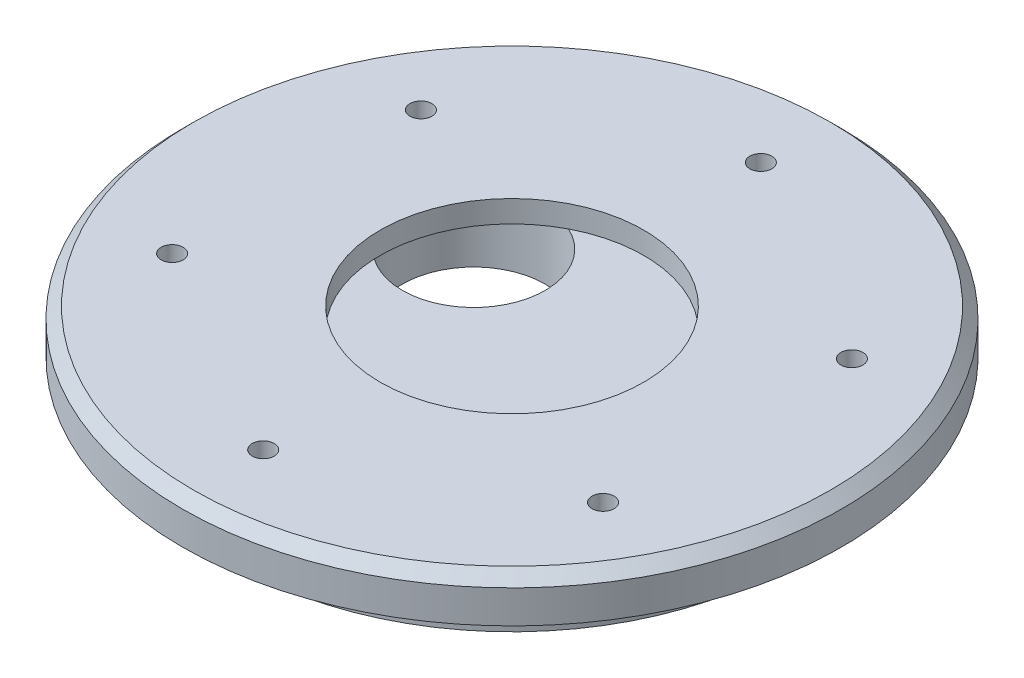
ISO-10303-21;
HEADER;
FILE_DESCRIPTION(('STEP AP214'),'2;1');
FILE_NAME('part.step','',(''),(''),'','','');
FILE_SCHEMA(('AUTOMOTIVE_DESIGN { 1 0 10303 214 1 1 1 1 }'));
ENDSEC;
DATA;
#1=APPLICATION_CONTEXT('core data for automotive mechanical design processes');
#2=APPLICATION_PROTOCOL_DEFINITION('international standard','automotive_design',2000,#1);
#3=PRODUCT_CONTEXT('',#1,'mechanical');
#4=PRODUCT('Part','Part','',(#3));
#5=PRODUCT_RELATED_PRODUCT_CATEGORY('part','',(#4));
#6=PRODUCT_DEFINITION_FORMATION('','',#4);
#7=PRODUCT_DEFINITION_CONTEXT('part definition',#1,'design');
#8=PRODUCT_DEFINITION('design','',#6,#7);
#9=PRODUCT_DEFINITION_SHAPE('','',#8);
#10=(LENGTH_UNIT() NAMED_UNIT(*) SI_UNIT(.MILLI.,.METRE.));
#11=(NAMED_UNIT(*) PLANE_ANGLE_UNIT() SI_UNIT($,.RADIAN.));
#12=(NAMED_UNIT(*) SI_UNIT($,.STERADIAN.) SOLID_ANGLE_UNIT());
#13=UNCERTAINTY_MEASURE_WITH_UNIT(LENGTH_MEASURE(1.E-05),#10,'distance_accuracy_value','');
#14=(GEOMETRIC_REPRESENTATION_CONTEXT(3) GLOBAL_UNCERTAINTY_ASSIGNED_CONTEXT((#13)) GLOBAL_UNIT_ASSIGNED_CONTEXT((#10,
#11,#12)) REPRESENTATION_CONTEXT('',''));
#15=CARTESIAN_POINT('',(0.,0.,0.));
#16=DIRECTION('',(0.,0.,1.));
#17=DIRECTION('',(1.,0.,0.));
#18=AXIS2_PLACEMENT_3D('',#15,#16,#17);
#19=CARTESIAN_POINT('',(0.,-4.,0.));
#20=DIRECTION('',(0.,1.,0.));
#21=DIRECTION('',(0.,0.,1.));
#22=AXIS2_PLACEMENT_3D('',#19,#20,#21);
#23=CYLINDRICAL_SURFACE('',#22,30.);
#24=CARTESIAN_POINT('',(0.,-0.999999999999994,0.));
#25=DIRECTION('',(0.,1.,0.));
#26=DIRECTION('',(0.,0.,1.));
#27=AXIS2_PLACEMENT_3D('',#24,#25,#26);
#28=CIRCLE('',#27,30.);
#29=CARTESIAN_POINT('',(0.,-0.999999999999994,30.));
#30=VERTEX_POINT('',#29);
#31=EDGE_CURVE('E11',#30,#30,#28,.F.);
#32=ORIENTED_EDGE('',*,*,#31,.T.);
#33=EDGE_LOOP('',(#32));
#34=FACE_BOUND('',#33,.T.);
#35=CARTESIAN_POINT('',(0.,-4.,0.));
#36=DIRECTION('',(0.,1.,0.));
#37=DIRECTION('',(0.,0.,1.));
#38=AXIS2_PLACEMENT_3D('',#35,#36,#37);
#39=CIRCLE('',#38,30.);
#40=CARTESIAN_POINT('',(0.,-4.,30.));
#41=VERTEX_POINT('',#40);
#42=EDGE_CURVE('E72',#41,#41,#39,.T.);
#43=ORIENTED_EDGE('',*,*,#42,.T.);
#44=EDGE_LOOP('',(#43));
#45=FACE_BOUND('',#44,.T.);
#46=ADVANCED_FACE('F33',(#34,#45),#23,.T.);
#47=CARTESIAN_POINT('',(0.,-4.,0.));
#48=DIRECTION('',(0.,1.,0.));
#49=DIRECTION('',(0.,0.,1.));
#50=AXIS2_PLACEMENT_3D('',#47,#48,#49);
#51=PLANE('',#50);
#52=CARTESIAN_POINT('',(0.,-4.,0.));
#53=DIRECTION('',(0.,1.,0.));
#54=DIRECTION('',(0.,0.,1.));
#55=AXIS2_PLACEMENT_3D('',#52,#53,#54);
#56=CIRCLE('',#55,25.);
#57=CARTESIAN_POINT('',(0.,-4.,25.));
#58=VERTEX_POINT('',#57);
#59=EDGE_CURVE('E83',#58,#58,#56,.F.);
#60=ORIENTED_EDGE('',*,*,#59,.F.);
#61=EDGE_LOOP('',(#60));
#62=FACE_BOUND('',#61,.T.);
#63=ORIENTED_EDGE('',*,*,#42,.F.);
#64=EDGE_LOOP('',(#63));
#65=FACE_BOUND('',#64,.T.);
#66=ADVANCED_FACE('F104',(#62,#65),#51,.F.);
#67=CARTESIAN_POINT('',(0.,0.,0.));
#68=DIRECTION('',(0.,1.,0.));
#69=DIRECTION('',(0.,0.,1.));
#70=AXIS2_PLACEMENT_3D('',#67,#68,#69);
#71=PLANE('',#70);
#72=CARTESIAN_POINT('',(19.6154753957174,0.,11.3250000000002));
#73=DIRECTION('',(0.,1.,0.));
#74=DIRECTION('',(0.,0.,1.));
#75=AXIS2_PLACEMENT_3D('',#72,#73,#74);
#76=CIRCLE('',#75,1.);
#77=CARTESIAN_POINT('',(19.6154753957174,0.,12.3250000000002));
#78=VERTEX_POINT('',#77);
#79=EDGE_CURVE('E251',#78,#78,#76,.T.);
#80=ORIENTED_EDGE('',*,*,#79,.F.);
#81=EDGE_LOOP('',(#80));
#82=FACE_BOUND('',#81,.T.);
#83=CARTESIAN_POINT('',(19.6154753957176,0.,-11.3249999999998));
#84=DIRECTION('',(0.,1.,0.));
#85=DIRECTION('',(0.,0.,1.));
#86=AXIS2_PLACEMENT_3D('',#83,#84,#85);
#87=CIRCLE('',#86,0.999999999999998);
#88=CARTESIAN_POINT('',(19.6154753957176,0.,-10.3249999999998));
#89=VERTEX_POINT('',#88);
#90=EDGE_CURVE('E255',#89,#89,#87,.T.);
#91=ORIENTED_EDGE('',*,*,#90,.F.);
#92=EDGE_LOOP('',(#91));
#93=FACE_BOUND('',#92,.T.);
#94=CARTESIAN_POINT('',(1.58164104649594E-13,0.,-22.65));
#95=DIRECTION('',(0.,1.,0.));
#96=DIRECTION('',(0.,0.,1.));
#97=AXIS2_PLACEMENT_3D('',#94,#95,#96);
#98=CIRCLE('',#97,1.);
#99=CARTESIAN_POINT('',(1.58164104649594E-13,0.,-21.65));
#100=VERTEX_POINT('',#99);
#101=EDGE_CURVE('E263',#100,#100,#98,.T.);
#102=ORIENTED_EDGE('',*,*,#101,.F.);
#103=EDGE_LOOP('',(#102));
#104=FACE_BOUND('',#103,.T.);
#105=CARTESIAN_POINT('',(-19.6154753957175,0.,-11.3250000000001));
#106=DIRECTION('',(0.,1.,0.));
#107=DIRECTION('',(0.,0.,1.));
#108=AXIS2_PLACEMENT_3D('',#105,#106,#107);
#109=CIRCLE('',#108,1.);
#110=CARTESIAN_POINT('',(-19.6154753957175,0.,-10.3250000000001));
#111=VERTEX_POINT('',#110);
#112=EDGE_CURVE('E269',#111,#111,#109,.T.);
#113=ORIENTED_EDGE('',*,*,#112,.F.);
#114=EDGE_LOOP('',(#113));
#115=FACE_BOUND('',#114,.T.);
#116=CARTESIAN_POINT('',(0.,0.,22.65));
#117=DIRECTION('',(0.,1.,0.));
#118=DIRECTION('',(0.,0.,1.));
#119=AXIS2_PLACEMENT_3D('',#116,#117,#118);
#120=CIRCLE('',#119,1.);
#121=CARTESIAN_POINT('',(0.,0.,23.65));
#122=VERTEX_POINT('',#121);
#123=EDGE_CURVE('E275',#122,#122,#120,.T.);
#124=ORIENTED_EDGE('',*,*,#123,.F.);
#125=EDGE_LOOP('',(#124));
#126=FACE_BOUND('',#125,.T.);
#127=CARTESIAN_POINT('',(-19.6154753957176,0.,11.325));
#128=DIRECTION('',(0.,1.,0.));
#129=DIRECTION('',(0.,0.,1.));
#130=AXIS2_PLACEMENT_3D('',#127,#128,#129);
#131=CIRCLE('',#130,1.);
#132=CARTESIAN_POINT('',(-19.6154753957176,0.,12.325));
#133=VERTEX_POINT('',#132);
#134=EDGE_CURVE('E79',#133,#133,#131,.T.);
#135=ORIENTED_EDGE('',*,*,#134,.F.);
#136=EDGE_LOOP('',(#135));
#137=FACE_BOUND('',#136,.T.);
#138=CARTESIAN_POINT('',(0.,0.,0.));
#139=DIRECTION('',(0.,1.,0.));
#140=DIRECTION('',(0.,0.,1.));
#141=AXIS2_PLACEMENT_3D('',#138,#139,#140);
#142=CIRCLE('',#141,29.);
#143=CARTESIAN_POINT('',(0.,0.,29.));
#144=VERTEX_POINT('',#143);
#145=EDGE_CURVE('E41',#144,#144,#142,.T.);
#146=ORIENTED_EDGE('',*,*,#145,.T.);
#147=EDGE_LOOP('',(#146));
#148=FACE_BOUND('',#147,.T.);
#149=CARTESIAN_POINT('',(0.,0.,0.));
#150=DIRECTION('',(0.,1.,0.));
#151=DIRECTION('',(0.,0.,1.));
#152=AXIS2_PLACEMENT_3D('',#149,#150,#151);
#153=CIRCLE('',#152,12.);
#154=CARTESIAN_POINT('',(0.,0.,12.));
#155=VERTEX_POINT('',#154);
#156=EDGE_CURVE('E66',#155,#155,#153,.T.);
#157=ORIENTED_EDGE('',*,*,#156,.F.);
#158=EDGE_LOOP('',(#157));
#159=FACE_BOUND('',#158,.T.);
#160=ADVANCED_FACE('F88',(#82,#93,#104,#115,#126,#137,#148,#159),#71,.T.);
#161=CARTESIAN_POINT('',(0.,-8.,0.));
#162=DIRECTION('',(0.,1.,0.));
#163=DIRECTION('',(0.,0.,1.));
#164=AXIS2_PLACEMENT_3D('',#161,#162,#163);
#165=CYLINDRICAL_SURFACE('',#164,25.);
#166=CARTESIAN_POINT('',(0.,-8.,0.));
#167=DIRECTION('',(0.,-1.,0.));
#168=DIRECTION('',(0.,0.,-1.));
#169=AXIS2_PLACEMENT_3D('',#166,#167,#168);
#170=CIRCLE('',#169,25.);
#171=CARTESIAN_POINT('',(0.,-8.,-25.));
#172=VERTEX_POINT('',#171);
#173=EDGE_CURVE('E70',#172,#172,#170,.T.);
#174=ORIENTED_EDGE('',*,*,#173,.F.);
#175=EDGE_LOOP('',(#174));
#176=FACE_BOUND('',#175,.T.);
#177=ORIENTED_EDGE('',*,*,#59,.T.);
#178=EDGE_LOOP('',(#177));
#179=FACE_BOUND('',#178,.T.);
#180=ADVANCED_FACE('F114',(#176,#179),#165,.T.);
#181=CARTESIAN_POINT('',(0.,-8.,0.));
#182=DIRECTION('',(0.,-1.,0.));
#183=DIRECTION('',(0.,0.,-1.));
#184=AXIS2_PLACEMENT_3D('',#181,#182,#183);
#185=PLANE('',#184);
#186=CARTESIAN_POINT('',(-8.22724133595214,-8.,-4.75000000000004));
#187=DIRECTION('',(0.,-1.,0.));
#188=DIRECTION('',(0.,0.,-1.));
#189=AXIS2_PLACEMENT_3D('',#186,#187,#188);
#190=CIRCLE('',#189,6.5);
#191=CARTESIAN_POINT('',(-8.22724133595214,-8.,-11.25));
#192=VERTEX_POINT('',#191);
#193=EDGE_CURVE('E55',#192,#192,#190,.T.);
#194=ORIENTED_EDGE('',*,*,#193,.F.);
#195=EDGE_LOOP('',(#194));
#196=FACE_BOUND('',#195,.T.);
#197=CARTESIAN_POINT('',(19.6154753957174,-8.,11.3250000000002));
#198=DIRECTION('',(0.,-1.,0.));
#199=DIRECTION('',(0.,0.,-1.));
#200=AXIS2_PLACEMENT_3D('',#197,#198,#199);
#201=CIRCLE('',#200,1.);
#202=CARTESIAN_POINT('',(19.6154753957174,-8.,10.3250000000002));
#203=VERTEX_POINT('',#202);
#204=EDGE_CURVE('E62',#203,#203,#201,.F.);
#205=ORIENTED_EDGE('',*,*,#204,.T.);
#206=EDGE_LOOP('',(#205));
#207=FACE_BOUND('',#206,.T.);
#208=CARTESIAN_POINT('',(19.6154753957176,-8.,-11.3249999999998));
#209=DIRECTION('',(0.,-1.,0.));
#210=DIRECTION('',(0.,0.,-1.));
#211=AXIS2_PLACEMENT_3D('',#208,#209,#210);
#212=CIRCLE('',#211,0.999999999999998);
#213=CARTESIAN_POINT('',(19.6154753957176,-8.,-12.3249999999998));
#214=VERTEX_POINT('',#213);
#215=EDGE_CURVE('E252',#214,#214,#212,.F.);
#216=ORIENTED_EDGE('',*,*,#215,.T.);
#217=EDGE_LOOP('',(#216));
#218=FACE_BOUND('',#217,.T.);
#219=CARTESIAN_POINT('',(1.58164104649594E-13,-8.,-22.65));
#220=DIRECTION('',(0.,-1.,0.));
#221=DIRECTION('',(0.,0.,-1.));
#222=AXIS2_PLACEMENT_3D('',#219,#220,#221);
#223=CIRCLE('',#222,1.);
#224=CARTESIAN_POINT('',(1.58164104649594E-13,-8.,-23.65));
#225=VERTEX_POINT('',#224);
#226=EDGE_CURVE('E261',#225,#225,#223,.F.);
#227=ORIENTED_EDGE('',*,*,#226,.T.);
#228=EDGE_LOOP('',(#227));
#229=FACE_BOUND('',#228,.T.);
#230=CARTESIAN_POINT('',(-19.6154753957175,-8.,-11.3250000000001));
#231=DIRECTION('',(0.,-1.,0.));
#232=DIRECTION('',(0.,0.,-1.));
#233=AXIS2_PLACEMENT_3D('',#230,#231,#232);
#234=CIRCLE('',#233,1.);
#235=CARTESIAN_POINT('',(-19.6154753957175,-8.,-12.3250000000001));
#236=VERTEX_POINT('',#235);
#237=EDGE_CURVE('E266',#236,#236,#234,.F.);
#238=ORIENTED_EDGE('',*,*,#237,.T.);
#239=EDGE_LOOP('',(#238));
#240=FACE_BOUND('',#239,.T.);
#241=CARTESIAN_POINT('',(0.,-8.,22.65));
#242=DIRECTION('',(0.,-1.,0.));
#243=DIRECTION('',(0.,0.,-1.));
#244=AXIS2_PLACEMENT_3D('',#241,#242,#243);
#245=CIRCLE('',#244,1.);
#246=CARTESIAN_POINT('',(0.,-8.,21.65));
#247=VERTEX_POINT('',#246);
#248=EDGE_CURVE('E272',#247,#247,#245,.F.);
#249=ORIENTED_EDGE('',*,*,#248,.T.);
#250=EDGE_LOOP('',(#249));
#251=FACE_BOUND('',#250,.T.);
#252=CARTESIAN_POINT('',(-19.6154753957176,-8.,11.325));
#253=DIRECTION('',(0.,-1.,0.));
#254=DIRECTION('',(0.,0.,-1.));
#255=AXIS2_PLACEMENT_3D('',#252,#253,#254);
#256=CIRCLE('',#255,1.);
#257=CARTESIAN_POINT('',(-19.6154753957176,-8.,10.3249999999999));
#258=VERTEX_POINT('',#257);
#259=EDGE_CURVE('E76',#258,#258,#256,.F.);
#260=ORIENTED_EDGE('',*,*,#259,.T.);
#261=EDGE_LOOP('',(#260));
#262=FACE_BOUND('',#261,.T.);
#263=ORIENTED_EDGE('',*,*,#173,.T.);
#264=EDGE_LOOP('',(#263));
#265=FACE_BOUND('',#264,.T.);
#266=ADVANCED_FACE('F119',(#196,#207,#218,#229,#240,#251,#262,#265),#185,.T.);
#267=CARTESIAN_POINT('',(0.,-2.,0.));
#268=DIRECTION('',(0.,1.,0.));
#269=DIRECTION('',(0.,0.,1.));
#270=AXIS2_PLACEMENT_3D('',#267,#268,#269);
#271=CYLINDRICAL_SURFACE('',#270,12.);
#272=CARTESIAN_POINT('',(0.,-2.,0.));
#273=DIRECTION('',(0.,1.,0.));
#274=DIRECTION('',(0.,0.,1.));
#275=AXIS2_PLACEMENT_3D('',#272,#273,#274);
#276=CIRCLE('',#275,12.);
#277=CARTESIAN_POINT('',(-5.51553541741335,-2.,-10.6573387418839));
#278=VERTEX_POINT('',#277);
#279=CARTESIAN_POINT('',(-11.9872937959142,-2.,0.552075583989054));
#280=VERTEX_POINT('',#279);
#281=EDGE_CURVE('E52',#278,#280,#276,.T.);
#282=ORIENTED_EDGE('',*,*,#281,.F.);
#283=EDGE_CURVE('E63',#280,#278,#276,.T.);
#284=ORIENTED_EDGE('',*,*,#283,.F.);
#285=EDGE_LOOP('',(#282,#284));
#286=FACE_BOUND('',#285,.T.);
#287=ORIENTED_EDGE('',*,*,#156,.T.);
#288=EDGE_LOOP('',(#287));
#289=FACE_BOUND('',#288,.T.);
#290=ADVANCED_FACE('F68',(#286,#289),#271,.F.);
#291=CARTESIAN_POINT('',(0.,-2.,0.));
#292=DIRECTION('',(0.,1.,0.));
#293=DIRECTION('',(0.,0.,1.));
#294=AXIS2_PLACEMENT_3D('',#291,#292,#293);
#295=PLANE('',#294);
#296=ORIENTED_EDGE('',*,*,#283,.T.);
#297=CARTESIAN_POINT('',(-8.22724133595214,-2.,-4.75000000000004));
#298=DIRECTION('',(0.,-1.,0.));
#299=DIRECTION('',(0.,0.,-1.));
#300=AXIS2_PLACEMENT_3D('',#297,#298,#299);
#301=CIRCLE('',#300,6.5);
#302=EDGE_CURVE('E54',#278,#280,#301,.T.);
#303=ORIENTED_EDGE('',*,*,#302,.T.);
#304=EDGE_LOOP('',(#296,#303));
#305=FACE_BOUND('',#304,.T.);
#306=ADVANCED_FACE('F64',(#305),#295,.T.);
#307=CARTESIAN_POINT('',(0.,0.,0.));
#308=DIRECTION('',(0.,-1.,0.));
#309=DIRECTION('',(0.,0.,-1.));
#310=AXIS2_PLACEMENT_3D('',#307,#308,#309);
#311=CONICAL_SURFACE('',#310,29.,0.78539816339745);
#312=ORIENTED_EDGE('',*,*,#31,.F.);
#313=EDGE_LOOP('',(#312));
#314=FACE_BOUND('',#313,.T.);
#315=ORIENTED_EDGE('',*,*,#145,.F.);
#316=EDGE_LOOP('',(#315));
#317=FACE_BOUND('',#316,.T.);
#318=ADVANCED_FACE('F35',(#314,#317),#311,.T.);
#319=CARTESIAN_POINT('',(-19.6154753957176,-8.001,11.325));
#320=DIRECTION('',(0.,1.,0.));
#321=DIRECTION('',(0.,0.,1.));
#322=AXIS2_PLACEMENT_3D('',#319,#320,#321);
#323=CYLINDRICAL_SURFACE('',#322,1.);
#324=ORIENTED_EDGE('',*,*,#259,.F.);
#325=EDGE_LOOP('',(#324));
#326=FACE_BOUND('',#325,.T.);
#327=ORIENTED_EDGE('',*,*,#134,.T.);
#328=EDGE_LOOP('',(#327));
#329=FACE_BOUND('',#328,.T.);
#330=ADVANCED_FACE('F92',(#326,#329),#323,.F.);
#331=CARTESIAN_POINT('',(0.,-8.001,22.65));
#332=DIRECTION('',(0.,1.,0.));
#333=DIRECTION('',(0.,0.,1.));
#334=AXIS2_PLACEMENT_3D('',#331,#332,#333);
#335=CYLINDRICAL_SURFACE('',#334,1.);
#336=ORIENTED_EDGE('',*,*,#248,.F.);
#337=EDGE_LOOP('',(#336));
#338=FACE_BOUND('',#337,.T.);
#339=ORIENTED_EDGE('',*,*,#123,.T.);
#340=EDGE_LOOP('',(#339));
#341=FACE_BOUND('',#340,.T.);
#342=ADVANCED_FACE('F98',(#338,#341),#335,.F.);
#343=CARTESIAN_POINT('',(-19.6154753957175,-8.001,-11.3250000000001));
#344=DIRECTION('',(0.,1.,0.));
#345=DIRECTION('',(0.,0.,1.));
#346=AXIS2_PLACEMENT_3D('',#343,#344,#345);
#347=CYLINDRICAL_SURFACE('',#346,1.);
#348=ORIENTED_EDGE('',*,*,#237,.F.);
#349=EDGE_LOOP('',(#348));
#350=FACE_BOUND('',#349,.T.);
#351=ORIENTED_EDGE('',*,*,#112,.T.);
#352=EDGE_LOOP('',(#351));
#353=FACE_BOUND('',#352,.T.);
#354=ADVANCED_FACE('F128',(#350,#353),#347,.F.);
#355=CARTESIAN_POINT('',(1.58164104649594E-13,-8.001,-22.65));
#356=DIRECTION('',(0.,1.,0.));
#357=DIRECTION('',(0.,0.,1.));
#358=AXIS2_PLACEMENT_3D('',#355,#356,#357);
#359=CYLINDRICAL_SURFACE('',#358,1.);
#360=ORIENTED_EDGE('',*,*,#226,.F.);
#361=EDGE_LOOP('',(#360));
#362=FACE_BOUND('',#361,.T.);
#363=ORIENTED_EDGE('',*,*,#101,.T.);
#364=EDGE_LOOP('',(#363));
#365=FACE_BOUND('',#364,.T.);
#366=ADVANCED_FACE('F132',(#362,#365),#359,.F.);
#367=CARTESIAN_POINT('',(19.6154753957176,-8.001,-11.3249999999998));
#368=DIRECTION('',(0.,1.,0.));
#369=DIRECTION('',(0.,0.,1.));
#370=AXIS2_PLACEMENT_3D('',#367,#368,#369);
#371=CYLINDRICAL_SURFACE('',#370,0.999999999999998);
#372=ORIENTED_EDGE('',*,*,#215,.F.);
#373=EDGE_LOOP('',(#372));
#374=FACE_BOUND('',#373,.T.);
#375=ORIENTED_EDGE('',*,*,#90,.T.);
#376=EDGE_LOOP('',(#375));
#377=FACE_BOUND('',#376,.T.);
#378=ADVANCED_FACE('F136',(#374,#377),#371,.F.);
#379=CARTESIAN_POINT('',(19.6154753957174,-8.001,11.3250000000002));
#380=DIRECTION('',(0.,1.,0.));
#381=DIRECTION('',(0.,0.,1.));
#382=AXIS2_PLACEMENT_3D('',#379,#380,#381);
#383=CYLINDRICAL_SURFACE('',#382,1.);
#384=ORIENTED_EDGE('',*,*,#204,.F.);
#385=EDGE_LOOP('',(#384));
#386=FACE_BOUND('',#385,.T.);
#387=ORIENTED_EDGE('',*,*,#79,.T.);
#388=EDGE_LOOP('',(#387));
#389=FACE_BOUND('',#388,.T.);
#390=ADVANCED_FACE('F140',(#386,#389),#383,.F.);
#391=CARTESIAN_POINT('',(-8.22724133595214,-2.,-4.75000000000004));
#392=DIRECTION('',(0.,-1.,0.));
#393=DIRECTION('',(0.,0.,-1.));
#394=AXIS2_PLACEMENT_3D('',#391,#392,#393);
#395=PLANE('',#394);
#396=ORIENTED_EDGE('',*,*,#281,.T.);
#397=EDGE_CURVE('E47',#280,#278,#301,.T.);
#398=ORIENTED_EDGE('',*,*,#397,.T.);
#399=EDGE_LOOP('',(#396,#398));
#400=FACE_BOUND('',#399,.T.);
#401=ADVANCED_FACE('F50',(#400),#395,.T.);
#402=CARTESIAN_POINT('',(-8.22724133595214,-2.,-4.75000000000004));
#403=DIRECTION('',(0.,-1.,0.));
#404=DIRECTION('',(0.,0.,-1.));
#405=AXIS2_PLACEMENT_3D('',#402,#403,#404);
#406=CYLINDRICAL_SURFACE('',#405,6.5);
#407=ORIENTED_EDGE('',*,*,#302,.F.);
#408=ORIENTED_EDGE('',*,*,#397,.F.);
#409=EDGE_LOOP('',(#407,#408));
#410=FACE_BOUND('',#409,.T.);
#411=ORIENTED_EDGE('',*,*,#193,.T.);
#412=EDGE_LOOP('',(#411));
#413=FACE_BOUND('',#412,.T.);
#414=ADVANCED_FACE('F58',(#410,#413),#406,.F.);
#415=CLOSED_SHELL('',(#46,#66,#160,#180,#266,#290,#306,#318,#330,#342,#354,#366,#378,#390,#401,#414));
#416=MANIFOLD_SOLID_BREP('B2',#415);
#417=ADVANCED_BREP_SHAPE_REPRESENTATION('',(#18,#416),#14);
#418=SHAPE_DEFINITION_REPRESENTATION(#9,#417);
ENDSEC;
END-ISO-10303-21;
